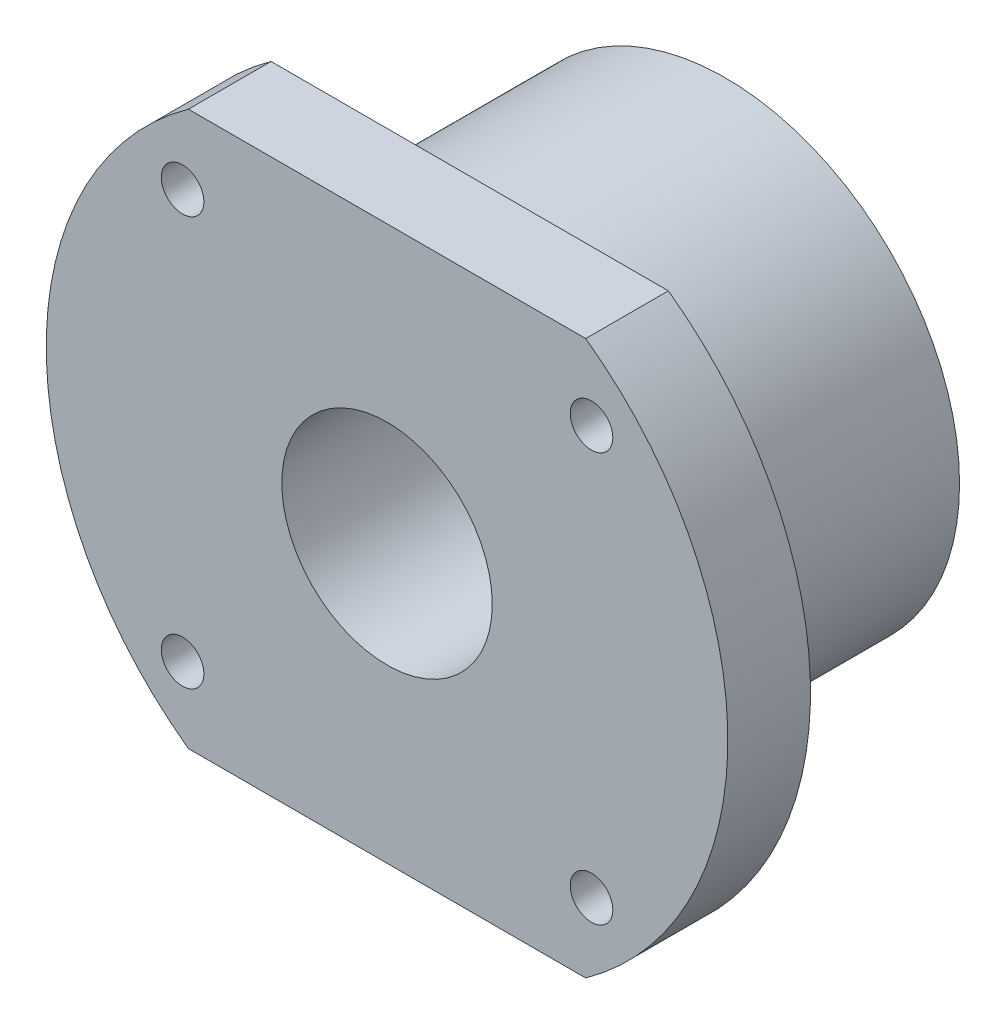
ISO-10303-21;
HEADER;
FILE_DESCRIPTION(('STEP AP214'),'2;1');
FILE_NAME('part.step','',(''),(''),'','','');
FILE_SCHEMA(('AUTOMOTIVE_DESIGN { 1 0 10303 214 1 1 1 1 }'));
ENDSEC;
DATA;
#1=APPLICATION_CONTEXT('core data for automotive mechanical design processes');
#2=APPLICATION_PROTOCOL_DEFINITION('international standard','automotive_design',2000,#1);
#3=PRODUCT_CONTEXT('',#1,'mechanical');
#4=PRODUCT('Part','Part','',(#3));
#5=PRODUCT_RELATED_PRODUCT_CATEGORY('part','',(#4));
#6=PRODUCT_DEFINITION_FORMATION('','',#4);
#7=PRODUCT_DEFINITION_CONTEXT('part definition',#1,'design');
#8=PRODUCT_DEFINITION('design','',#6,#7);
#9=PRODUCT_DEFINITION_SHAPE('','',#8);
#10=(LENGTH_UNIT() NAMED_UNIT(*) SI_UNIT(.MILLI.,.METRE.));
#11=(NAMED_UNIT(*) PLANE_ANGLE_UNIT() SI_UNIT($,.RADIAN.));
#12=(NAMED_UNIT(*) SI_UNIT($,.STERADIAN.) SOLID_ANGLE_UNIT());
#13=UNCERTAINTY_MEASURE_WITH_UNIT(LENGTH_MEASURE(1.E-05),#10,'distance_accuracy_value','');
#14=(GEOMETRIC_REPRESENTATION_CONTEXT(3) GLOBAL_UNCERTAINTY_ASSIGNED_CONTEXT((#13)) GLOBAL_UNIT_ASSIGNED_CONTEXT((#10,
#11,#12)) REPRESENTATION_CONTEXT('',''));
#15=CARTESIAN_POINT('',(0.,0.,0.));
#16=DIRECTION('',(0.,0.,1.));
#17=DIRECTION('',(1.,0.,0.));
#18=AXIS2_PLACEMENT_3D('',#15,#16,#17);
#19=CARTESIAN_POINT('',(0.,0.,39.7));
#20=DIRECTION('',(0.,0.,-1.));
#21=DIRECTION('',(-1.,0.,0.));
#22=AXIS2_PLACEMENT_3D('',#19,#20,#21);
#23=CYLINDRICAL_SURFACE('',#22,40.);
#24=CARTESIAN_POINT('',(0.,0.,30.));
#25=DIRECTION('',(0.,0.,1.));
#26=DIRECTION('',(1.,0.,0.));
#27=AXIS2_PLACEMENT_3D('',#24,#25,#26);
#28=CIRCLE('',#27,40.);
#29=CARTESIAN_POINT('',(-23.3184476327221,32.5,30.));
#30=VERTEX_POINT('',#29);
#31=CARTESIAN_POINT('',(-23.318447632722,-32.5,30.));
#32=VERTEX_POINT('',#31);
#33=EDGE_CURVE('E90',#30,#32,#28,.T.);
#34=ORIENTED_EDGE('',*,*,#33,.T.);
#35=DIRECTION('',(0.,0.,-1.));
#36=VECTOR('',#35,1.);
#37=CARTESIAN_POINT('',(-23.318447632722,-32.5,39.7));
#38=LINE('',#37,#36);
#39=CARTESIAN_POINT('',(-23.318447632722,-32.5,39.7));
#40=VERTEX_POINT('',#39);
#41=EDGE_CURVE('E47',#32,#40,#38,.F.);
#42=ORIENTED_EDGE('',*,*,#41,.T.);
#43=CARTESIAN_POINT('',(0.,0.,39.7));
#44=DIRECTION('',(0.,0.,1.));
#45=DIRECTION('',(1.,0.,0.));
#46=AXIS2_PLACEMENT_3D('',#43,#44,#45);
#47=CIRCLE('',#46,40.);
#48=CARTESIAN_POINT('',(-23.3184476327221,32.5,39.7));
#49=VERTEX_POINT('',#48);
#50=EDGE_CURVE('E85',#49,#40,#47,.T.);
#51=ORIENTED_EDGE('',*,*,#50,.F.);
#52=DIRECTION('',(0.,0.,-1.));
#53=VECTOR('',#52,1.);
#54=CARTESIAN_POINT('',(-23.318447632722,32.5,39.7));
#55=LINE('',#54,#53);
#56=EDGE_CURVE('E96',#49,#30,#55,.T.);
#57=ORIENTED_EDGE('',*,*,#56,.T.);
#58=EDGE_LOOP('',(#34,#42,#51,#57));
#59=FACE_BOUND('',#58,.T.);
#60=ADVANCED_FACE('F32',(#59),#23,.T.);
#61=CARTESIAN_POINT('',(0.,0.,30.));
#62=DIRECTION('',(0.,0.,-1.));
#63=DIRECTION('',(-1.,0.,0.));
#64=AXIS2_PLACEMENT_3D('',#61,#62,#63);
#65=CYLINDRICAL_SURFACE('',#64,27.5);
#66=CARTESIAN_POINT('',(0.,0.,30.));
#67=DIRECTION('',(0.,0.,1.));
#68=DIRECTION('',(1.,0.,0.));
#69=AXIS2_PLACEMENT_3D('',#66,#67,#68);
#70=CIRCLE('',#69,27.5);
#71=CARTESIAN_POINT('',(27.5,0.,30.));
#72=VERTEX_POINT('',#71);
#73=EDGE_CURVE('E99',#72,#72,#70,.T.);
#74=ORIENTED_EDGE('',*,*,#73,.F.);
#75=EDGE_LOOP('',(#74));
#76=FACE_BOUND('',#75,.T.);
#77=CARTESIAN_POINT('',(0.,0.,0.));
#78=DIRECTION('',(0.,0.,1.));
#79=DIRECTION('',(1.,0.,0.));
#80=AXIS2_PLACEMENT_3D('',#77,#78,#79);
#81=CIRCLE('',#80,27.5);
#82=CARTESIAN_POINT('',(27.5,0.,0.));
#83=VERTEX_POINT('',#82);
#84=EDGE_CURVE('E92',#83,#83,#81,.T.);
#85=ORIENTED_EDGE('',*,*,#84,.T.);
#86=EDGE_LOOP('',(#85));
#87=FACE_BOUND('',#86,.T.);
#88=ADVANCED_FACE('F34',(#76,#87),#65,.T.);
#89=CARTESIAN_POINT('',(0.,0.,0.));
#90=DIRECTION('',(0.,0.,1.));
#91=DIRECTION('',(1.,0.,0.));
#92=AXIS2_PLACEMENT_3D('',#89,#90,#91);
#93=PLANE('',#92);
#94=CARTESIAN_POINT('',(0.,0.,0.));
#95=DIRECTION('',(0.,0.,1.));
#96=DIRECTION('',(1.,0.,0.));
#97=AXIS2_PLACEMENT_3D('',#94,#95,#96);
#98=CIRCLE('',#97,12.35);
#99=CARTESIAN_POINT('',(12.35,0.,0.));
#100=VERTEX_POINT('',#99);
#101=EDGE_CURVE('E114',#100,#100,#98,.T.);
#102=ORIENTED_EDGE('',*,*,#101,.T.);
#103=EDGE_LOOP('',(#102));
#104=FACE_BOUND('',#103,.T.);
#105=ORIENTED_EDGE('',*,*,#84,.F.);
#106=EDGE_LOOP('',(#105));
#107=FACE_BOUND('',#106,.T.);
#108=ADVANCED_FACE('F168',(#104,#107),#93,.F.);
#109=CARTESIAN_POINT('',(23.318447632722,-32.5,39.7));
#110=VERTEX_POINT('',#109);
#111=CARTESIAN_POINT('',(23.318447632722,32.5,39.7));
#112=VERTEX_POINT('',#111);
#113=EDGE_CURVE('E82',#110,#112,#47,.T.);
#114=ORIENTED_EDGE('',*,*,#113,.F.);
#115=DIRECTION('',(0.,0.,-1.));
#116=VECTOR('',#115,1.);
#117=CARTESIAN_POINT('',(23.318447632722,-32.5,39.7));
#118=LINE('',#117,#116);
#119=CARTESIAN_POINT('',(23.318447632722,-32.5,30.));
#120=VERTEX_POINT('',#119);
#121=EDGE_CURVE('E71',#110,#120,#118,.T.);
#122=ORIENTED_EDGE('',*,*,#121,.T.);
#123=CARTESIAN_POINT('',(23.318447632722,32.5,30.));
#124=VERTEX_POINT('',#123);
#125=EDGE_CURVE('E54',#120,#124,#28,.T.);
#126=ORIENTED_EDGE('',*,*,#125,.T.);
#127=DIRECTION('',(0.,0.,-1.));
#128=VECTOR('',#127,1.);
#129=CARTESIAN_POINT('',(23.318447632722,32.5,39.7));
#130=LINE('',#129,#128);
#131=EDGE_CURVE('E89',#124,#112,#130,.F.);
#132=ORIENTED_EDGE('',*,*,#131,.T.);
#133=EDGE_LOOP('',(#114,#122,#126,#132));
#134=FACE_BOUND('',#133,.T.);
#135=ADVANCED_FACE('F88',(#134),#23,.T.);
#136=CARTESIAN_POINT('',(0.,0.,39.7));
#137=DIRECTION('',(0.,0.,1.));
#138=DIRECTION('',(1.,0.,0.));
#139=AXIS2_PLACEMENT_3D('',#136,#137,#138);
#140=PLANE('',#139);
#141=CARTESIAN_POINT('',(-24.,-24.,39.7));
#142=DIRECTION('',(0.,0.,1.));
#143=DIRECTION('',(1.,0.,0.));
#144=AXIS2_PLACEMENT_3D('',#141,#142,#143);
#145=CIRCLE('',#144,2.5);
#146=CARTESIAN_POINT('',(-21.5,-24.,39.7));
#147=VERTEX_POINT('',#146);
#148=EDGE_CURVE('E126',#147,#147,#145,.T.);
#149=ORIENTED_EDGE('',*,*,#148,.F.);
#150=EDGE_LOOP('',(#149));
#151=FACE_BOUND('',#150,.T.);
#152=CARTESIAN_POINT('',(24.,24.,39.7));
#153=DIRECTION('',(0.,0.,1.));
#154=DIRECTION('',(1.,0.,0.));
#155=AXIS2_PLACEMENT_3D('',#152,#153,#154);
#156=CIRCLE('',#155,2.49999999999999);
#157=CARTESIAN_POINT('',(26.5,24.,39.7));
#158=VERTEX_POINT('',#157);
#159=EDGE_CURVE('E132',#158,#158,#156,.T.);
#160=ORIENTED_EDGE('',*,*,#159,.F.);
#161=EDGE_LOOP('',(#160));
#162=FACE_BOUND('',#161,.T.);
#163=CARTESIAN_POINT('',(24.,-24.,39.7));
#164=DIRECTION('',(0.,0.,1.));
#165=DIRECTION('',(1.,0.,0.));
#166=AXIS2_PLACEMENT_3D('',#163,#164,#165);
#167=CIRCLE('',#166,2.49999999999999);
#168=CARTESIAN_POINT('',(26.5,-24.,39.7));
#169=VERTEX_POINT('',#168);
#170=EDGE_CURVE('E138',#169,#169,#167,.T.);
#171=ORIENTED_EDGE('',*,*,#170,.F.);
#172=EDGE_LOOP('',(#171));
#173=FACE_BOUND('',#172,.T.);
#174=CARTESIAN_POINT('',(-24.,24.,39.7));
#175=DIRECTION('',(0.,0.,1.));
#176=DIRECTION('',(1.,0.,0.));
#177=AXIS2_PLACEMENT_3D('',#174,#175,#176);
#178=CIRCLE('',#177,2.5);
#179=CARTESIAN_POINT('',(-21.5,24.,39.7));
#180=VERTEX_POINT('',#179);
#181=EDGE_CURVE('E120',#180,#180,#178,.T.);
#182=ORIENTED_EDGE('',*,*,#181,.F.);
#183=EDGE_LOOP('',(#182));
#184=FACE_BOUND('',#183,.T.);
#185=CARTESIAN_POINT('',(0.,0.,39.7));
#186=DIRECTION('',(0.,0.,1.));
#187=DIRECTION('',(1.,0.,0.));
#188=AXIS2_PLACEMENT_3D('',#185,#186,#187);
#189=CIRCLE('',#188,12.35);
#190=CARTESIAN_POINT('',(12.35,0.,39.7));
#191=VERTEX_POINT('',#190);
#192=EDGE_CURVE('E86',#191,#191,#189,.T.);
#193=ORIENTED_EDGE('',*,*,#192,.F.);
#194=EDGE_LOOP('',(#193));
#195=FACE_BOUND('',#194,.T.);
#196=DIRECTION('',(-1.,0.,0.));
#197=VECTOR('',#196,1.);
#198=CARTESIAN_POINT('',(50.9827740692134,-32.5,39.7));
#199=LINE('',#198,#197);
#200=EDGE_CURVE('E74',#110,#40,#199,.T.);
#201=ORIENTED_EDGE('',*,*,#200,.F.);
#202=ORIENTED_EDGE('',*,*,#113,.T.);
#203=DIRECTION('',(1.,0.,0.));
#204=VECTOR('',#203,1.);
#205=CARTESIAN_POINT('',(-55.0137107258434,32.5,39.7));
#206=LINE('',#205,#204);
#207=EDGE_CURVE('E76',#49,#112,#206,.T.);
#208=ORIENTED_EDGE('',*,*,#207,.F.);
#209=ORIENTED_EDGE('',*,*,#50,.T.);
#210=EDGE_LOOP('',(#201,#202,#208,#209));
#211=FACE_BOUND('',#210,.T.);
#212=ADVANCED_FACE('F80',(#151,#162,#173,#184,#195,#211),#140,.T.);
#213=CARTESIAN_POINT('',(0.,0.,30.));
#214=DIRECTION('',(0.,0.,1.));
#215=DIRECTION('',(1.,0.,0.));
#216=AXIS2_PLACEMENT_3D('',#213,#214,#215);
#217=PLANE('',#216);
#218=CARTESIAN_POINT('',(-24.,-24.,30.));
#219=DIRECTION('',(0.,0.,1.));
#220=DIRECTION('',(1.,0.,0.));
#221=AXIS2_PLACEMENT_3D('',#218,#219,#220);
#222=CIRCLE('',#221,2.5);
#223=CARTESIAN_POINT('',(-21.5,-24.,30.));
#224=VERTEX_POINT('',#223);
#225=EDGE_CURVE('E129',#224,#224,#222,.T.);
#226=ORIENTED_EDGE('',*,*,#225,.T.);
#227=EDGE_LOOP('',(#226));
#228=FACE_BOUND('',#227,.T.);
#229=CARTESIAN_POINT('',(24.,24.,30.));
#230=DIRECTION('',(0.,0.,1.));
#231=DIRECTION('',(1.,0.,0.));
#232=AXIS2_PLACEMENT_3D('',#229,#230,#231);
#233=CIRCLE('',#232,2.49999999999999);
#234=CARTESIAN_POINT('',(26.5,24.,30.));
#235=VERTEX_POINT('',#234);
#236=EDGE_CURVE('E135',#235,#235,#233,.T.);
#237=ORIENTED_EDGE('',*,*,#236,.T.);
#238=EDGE_LOOP('',(#237));
#239=FACE_BOUND('',#238,.T.);
#240=CARTESIAN_POINT('',(24.,-24.,30.));
#241=DIRECTION('',(0.,0.,1.));
#242=DIRECTION('',(1.,0.,0.));
#243=AXIS2_PLACEMENT_3D('',#240,#241,#242);
#244=CIRCLE('',#243,2.49999999999999);
#245=CARTESIAN_POINT('',(26.5,-24.,30.));
#246=VERTEX_POINT('',#245);
#247=EDGE_CURVE('E123',#246,#246,#244,.T.);
#248=ORIENTED_EDGE('',*,*,#247,.T.);
#249=EDGE_LOOP('',(#248));
#250=FACE_BOUND('',#249,.T.);
#251=CARTESIAN_POINT('',(-24.,24.,30.));
#252=DIRECTION('',(0.,0.,1.));
#253=DIRECTION('',(1.,0.,0.));
#254=AXIS2_PLACEMENT_3D('',#251,#252,#253);
#255=CIRCLE('',#254,2.5);
#256=CARTESIAN_POINT('',(-21.5,24.,30.));
#257=VERTEX_POINT('',#256);
#258=EDGE_CURVE('E117',#257,#257,#255,.T.);
#259=ORIENTED_EDGE('',*,*,#258,.T.);
#260=EDGE_LOOP('',(#259));
#261=FACE_BOUND('',#260,.T.);
#262=ORIENTED_EDGE('',*,*,#73,.T.);
#263=EDGE_LOOP('',(#262));
#264=FACE_BOUND('',#263,.T.);
#265=ORIENTED_EDGE('',*,*,#125,.F.);
#266=DIRECTION('',(-1.,0.,0.));
#267=VECTOR('',#266,1.);
#268=CARTESIAN_POINT('',(0.,-32.5,30.));
#269=LINE('',#268,#267);
#270=EDGE_CURVE('E11',#120,#32,#269,.T.);
#271=ORIENTED_EDGE('',*,*,#270,.T.);
#272=ORIENTED_EDGE('',*,*,#33,.F.);
#273=DIRECTION('',(1.,0.,0.));
#274=VECTOR('',#273,1.);
#275=CARTESIAN_POINT('',(0.,32.5,30.));
#276=LINE('',#275,#274);
#277=EDGE_CURVE('E40',#30,#124,#276,.T.);
#278=ORIENTED_EDGE('',*,*,#277,.T.);
#279=EDGE_LOOP('',(#265,#271,#272,#278));
#280=FACE_BOUND('',#279,.T.);
#281=ADVANCED_FACE('F106',(#228,#239,#250,#261,#264,#280),#217,.F.);
#282=CARTESIAN_POINT('',(-55.0137107258434,32.5,30.));
#283=DIRECTION('',(0.,-1.,0.));
#284=DIRECTION('',(0.,0.,-1.));
#285=AXIS2_PLACEMENT_3D('',#282,#283,#284);
#286=PLANE('',#285);
#287=ORIENTED_EDGE('',*,*,#207,.T.);
#288=ORIENTED_EDGE('',*,*,#131,.F.);
#289=ORIENTED_EDGE('',*,*,#277,.F.);
#290=ORIENTED_EDGE('',*,*,#56,.F.);
#291=EDGE_LOOP('',(#287,#288,#289,#290));
#292=FACE_BOUND('',#291,.T.);
#293=ADVANCED_FACE('F109',(#292),#286,.F.);
#294=CARTESIAN_POINT('',(50.9827740692134,-32.5,30.));
#295=DIRECTION('',(0.,1.,0.));
#296=DIRECTION('',(-1.,0.,0.));
#297=AXIS2_PLACEMENT_3D('',#294,#295,#296);
#298=PLANE('',#297);
#299=ORIENTED_EDGE('',*,*,#200,.T.);
#300=ORIENTED_EDGE('',*,*,#41,.F.);
#301=ORIENTED_EDGE('',*,*,#270,.F.);
#302=ORIENTED_EDGE('',*,*,#121,.F.);
#303=EDGE_LOOP('',(#299,#300,#301,#302));
#304=FACE_BOUND('',#303,.T.);
#305=ADVANCED_FACE('F73',(#304),#298,.F.);
#306=CARTESIAN_POINT('',(0.,0.,39.7));
#307=DIRECTION('',(0.,0.,-1.));
#308=DIRECTION('',(-1.,0.,0.));
#309=AXIS2_PLACEMENT_3D('',#306,#307,#308);
#310=CYLINDRICAL_SURFACE('',#309,12.35);
#311=ORIENTED_EDGE('',*,*,#192,.T.);
#312=EDGE_LOOP('',(#311));
#313=FACE_BOUND('',#312,.T.);
#314=ORIENTED_EDGE('',*,*,#101,.F.);
#315=EDGE_LOOP('',(#314));
#316=FACE_BOUND('',#315,.T.);
#317=ADVANCED_FACE('F162',(#313,#316),#310,.F.);
#318=CARTESIAN_POINT('',(-24.,24.,30.));
#319=DIRECTION('',(0.,0.,1.));
#320=DIRECTION('',(1.,0.,0.));
#321=AXIS2_PLACEMENT_3D('',#318,#319,#320);
#322=CYLINDRICAL_SURFACE('',#321,2.5);
#323=ORIENTED_EDGE('',*,*,#258,.F.);
#324=EDGE_LOOP('',(#323));
#325=FACE_BOUND('',#324,.T.);
#326=ORIENTED_EDGE('',*,*,#181,.T.);
#327=EDGE_LOOP('',(#326));
#328=FACE_BOUND('',#327,.T.);
#329=ADVANCED_FACE('F150',(#325,#328),#322,.F.);
#330=CARTESIAN_POINT('',(24.,-24.,30.));
#331=DIRECTION('',(0.,0.,1.));
#332=DIRECTION('',(1.,0.,0.));
#333=AXIS2_PLACEMENT_3D('',#330,#331,#332);
#334=CYLINDRICAL_SURFACE('',#333,2.49999999999999);
#335=ORIENTED_EDGE('',*,*,#247,.F.);
#336=EDGE_LOOP('',(#335));
#337=FACE_BOUND('',#336,.T.);
#338=ORIENTED_EDGE('',*,*,#170,.T.);
#339=EDGE_LOOP('',(#338));
#340=FACE_BOUND('',#339,.T.);
#341=ADVANCED_FACE('F146',(#337,#340),#334,.F.);
#342=CARTESIAN_POINT('',(24.,24.,30.));
#343=DIRECTION('',(0.,0.,1.));
#344=DIRECTION('',(1.,0.,0.));
#345=AXIS2_PLACEMENT_3D('',#342,#343,#344);
#346=CYLINDRICAL_SURFACE('',#345,2.49999999999999);
#347=ORIENTED_EDGE('',*,*,#236,.F.);
#348=EDGE_LOOP('',(#347));
#349=FACE_BOUND('',#348,.T.);
#350=ORIENTED_EDGE('',*,*,#159,.T.);
#351=EDGE_LOOP('',(#350));
#352=FACE_BOUND('',#351,.T.);
#353=ADVANCED_FACE('F149',(#349,#352),#346,.F.);
#354=CARTESIAN_POINT('',(-24.,-24.,30.));
#355=DIRECTION('',(0.,0.,1.));
#356=DIRECTION('',(1.,0.,0.));
#357=AXIS2_PLACEMENT_3D('',#354,#355,#356);
#358=CYLINDRICAL_SURFACE('',#357,2.5);
#359=ORIENTED_EDGE('',*,*,#225,.F.);
#360=EDGE_LOOP('',(#359));
#361=FACE_BOUND('',#360,.T.);
#362=ORIENTED_EDGE('',*,*,#148,.T.);
#363=EDGE_LOOP('',(#362));
#364=FACE_BOUND('',#363,.T.);
#365=ADVANCED_FACE('F232',(#361,#364),#358,.F.);
#366=CLOSED_SHELL('',(#60,#88,#108,#135,#212,#281,#293,#305,#317,#329,#341,#353,#365));
#367=MANIFOLD_SOLID_BREP('B2',#366);
#368=ADVANCED_BREP_SHAPE_REPRESENTATION('',(#18,#367),#14);
#369=SHAPE_DEFINITION_REPRESENTATION(#9,#368);
ENDSEC;
END-ISO-10303-21;
